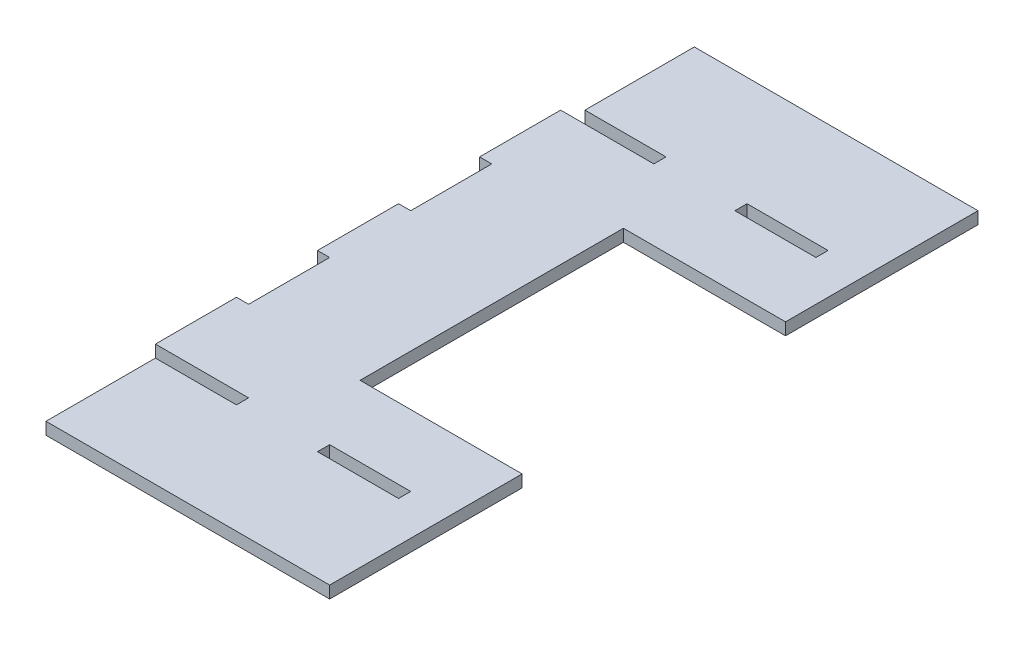
ISO-10303-21;
HEADER;
FILE_DESCRIPTION(('STEP AP214'),'2;1');
FILE_NAME('part.step','',(''),(''),'','','');
FILE_SCHEMA(('AUTOMOTIVE_DESIGN { 1 0 10303 214 1 1 1 1 }'));
ENDSEC;
DATA;
#1=APPLICATION_CONTEXT('core data for automotive mechanical design processes');
#2=APPLICATION_PROTOCOL_DEFINITION('international standard','automotive_design',2000,#1);
#3=PRODUCT_CONTEXT('',#1,'mechanical');
#4=PRODUCT('Part','Part','',(#3));
#5=PRODUCT_RELATED_PRODUCT_CATEGORY('part','',(#4));
#6=PRODUCT_DEFINITION_FORMATION('','',#4);
#7=PRODUCT_DEFINITION_CONTEXT('part definition',#1,'design');
#8=PRODUCT_DEFINITION('design','',#6,#7);
#9=PRODUCT_DEFINITION_SHAPE('','',#8);
#10=(LENGTH_UNIT() NAMED_UNIT(*) SI_UNIT(.MILLI.,.METRE.));
#11=(NAMED_UNIT(*) PLANE_ANGLE_UNIT() SI_UNIT($,.RADIAN.));
#12=(NAMED_UNIT(*) SI_UNIT($,.STERADIAN.) SOLID_ANGLE_UNIT());
#13=UNCERTAINTY_MEASURE_WITH_UNIT(LENGTH_MEASURE(1.E-05),#10,'distance_accuracy_value','');
#14=(GEOMETRIC_REPRESENTATION_CONTEXT(3) GLOBAL_UNCERTAINTY_ASSIGNED_CONTEXT((#13)) GLOBAL_UNIT_ASSIGNED_CONTEXT((#10,
#11,#12)) REPRESENTATION_CONTEXT('',''));
#15=CARTESIAN_POINT('',(0.,0.,0.));
#16=DIRECTION('',(0.,0.,1.));
#17=DIRECTION('',(1.,0.,0.));
#18=AXIS2_PLACEMENT_3D('',#15,#16,#17);
#19=CARTESIAN_POINT('',(70.,3.,0.));
#20=DIRECTION('',(-1.,0.,0.));
#21=DIRECTION('',(0.,0.,1.));
#22=AXIS2_PLACEMENT_3D('',#19,#20,#21);
#23=PLANE('',#22);
#24=DIRECTION('',(0.,1.,0.));
#25=VECTOR('',#24,1.);
#26=CARTESIAN_POINT('',(70.,-22.,-47.5));
#27=LINE('',#26,#25);
#28=CARTESIAN_POINT('',(70.,0.,-47.5));
#29=VERTEX_POINT('',#28);
#30=CARTESIAN_POINT('',(70.,3.,-47.5));
#31=VERTEX_POINT('',#30);
#32=EDGE_CURVE('E296',#29,#31,#27,.T.);
#33=ORIENTED_EDGE('',*,*,#32,.T.);
#34=DIRECTION('',(0.,0.,-1.));
#35=VECTOR('',#34,1.);
#36=CARTESIAN_POINT('',(70.,3.,0.));
#37=LINE('',#36,#35);
#38=CARTESIAN_POINT('',(70.,3.,0.));
#39=VERTEX_POINT('',#38);
#40=EDGE_CURVE('E279',#39,#31,#37,.T.);
#41=ORIENTED_EDGE('',*,*,#40,.F.);
#42=DIRECTION('',(0.,-1.,0.));
#43=VECTOR('',#42,1.);
#44=CARTESIAN_POINT('',(70.,3.,0.));
#45=LINE('',#44,#43);
#46=CARTESIAN_POINT('',(70.,0.,0.));
#47=VERTEX_POINT('',#46);
#48=EDGE_CURVE('E632',#39,#47,#45,.T.);
#49=ORIENTED_EDGE('',*,*,#48,.T.);
#50=DIRECTION('',(0.,0.,-1.));
#51=VECTOR('',#50,1.);
#52=CARTESIAN_POINT('',(70.,0.,0.));
#53=LINE('',#52,#51);
#54=EDGE_CURVE('E612',#47,#29,#53,.T.);
#55=ORIENTED_EDGE('',*,*,#54,.T.);
#56=EDGE_LOOP('',(#33,#41,#49,#55));
#57=FACE_BOUND('',#56,.T.);
#58=ADVANCED_FACE('F48',(#57),#23,.F.);
#59=CARTESIAN_POINT('',(0.,3.,0.));
#60=DIRECTION('',(0.,-1.,0.));
#61=DIRECTION('',(0.,0.,-1.));
#62=AXIS2_PLACEMENT_3D('',#59,#60,#61);
#63=PLANE('',#62);
#64=DIRECTION('',(1.,0.,0.));
#65=VECTOR('',#64,1.);
#66=CARTESIAN_POINT('',(40.,3.,-130.));
#67=LINE('',#66,#65);
#68=CARTESIAN_POINT('',(40.,3.,-130.));
#69=VERTEX_POINT('',#68);
#70=CARTESIAN_POINT('',(60.,3.,-130.));
#71=VERTEX_POINT('',#70);
#72=EDGE_CURVE('E540',#69,#71,#67,.T.);
#73=ORIENTED_EDGE('',*,*,#72,.F.);
#74=DIRECTION('',(0.,0.,1.));
#75=VECTOR('',#74,1.);
#76=CARTESIAN_POINT('',(40.,3.,-133.));
#77=LINE('',#76,#75);
#78=CARTESIAN_POINT('',(40.,3.,-133.));
#79=VERTEX_POINT('',#78);
#80=EDGE_CURVE('E535',#79,#69,#77,.T.);
#81=ORIENTED_EDGE('',*,*,#80,.F.);
#82=DIRECTION('',(-1.,0.,0.));
#83=VECTOR('',#82,1.);
#84=CARTESIAN_POINT('',(40.,3.,-133.));
#85=LINE('',#84,#83);
#86=CARTESIAN_POINT('',(60.,3.,-133.));
#87=VERTEX_POINT('',#86);
#88=EDGE_CURVE('E521',#87,#79,#85,.T.);
#89=ORIENTED_EDGE('',*,*,#88,.F.);
#90=DIRECTION('',(0.,0.,-1.));
#91=VECTOR('',#90,1.);
#92=CARTESIAN_POINT('',(60.,3.,-133.));
#93=LINE('',#92,#91);
#94=EDGE_CURVE('E551',#71,#87,#93,.T.);
#95=ORIENTED_EDGE('',*,*,#94,.F.);
#96=EDGE_LOOP('',(#73,#81,#89,#95));
#97=FACE_BOUND('',#96,.T.);
#98=DIRECTION('',(1.,0.,0.));
#99=VECTOR('',#98,1.);
#100=CARTESIAN_POINT('',(40.,3.,-27.));
#101=LINE('',#100,#99);
#102=CARTESIAN_POINT('',(40.,3.,-27.));
#103=VERTEX_POINT('',#102);
#104=CARTESIAN_POINT('',(60.,3.,-27.));
#105=VERTEX_POINT('',#104);
#106=EDGE_CURVE('E466',#103,#105,#101,.T.);
#107=ORIENTED_EDGE('',*,*,#106,.F.);
#108=DIRECTION('',(0.,0.,1.));
#109=VECTOR('',#108,1.);
#110=CARTESIAN_POINT('',(40.,3.,-30.));
#111=LINE('',#110,#109);
#112=CARTESIAN_POINT('',(40.,3.,-30.));
#113=VERTEX_POINT('',#112);
#114=EDGE_CURVE('E458',#113,#103,#111,.T.);
#115=ORIENTED_EDGE('',*,*,#114,.F.);
#116=DIRECTION('',(-1.,0.,0.));
#117=VECTOR('',#116,1.);
#118=CARTESIAN_POINT('',(40.,3.,-30.));
#119=LINE('',#118,#117);
#120=CARTESIAN_POINT('',(60.,3.,-30.));
#121=VERTEX_POINT('',#120);
#122=EDGE_CURVE('E484',#121,#113,#119,.T.);
#123=ORIENTED_EDGE('',*,*,#122,.F.);
#124=DIRECTION('',(0.,0.,-1.));
#125=VECTOR('',#124,1.);
#126=CARTESIAN_POINT('',(60.,3.,-30.));
#127=LINE('',#126,#125);
#128=EDGE_CURVE('E473',#105,#121,#127,.T.);
#129=ORIENTED_EDGE('',*,*,#128,.F.);
#130=EDGE_LOOP('',(#107,#115,#123,#129));
#131=FACE_BOUND('',#130,.T.);
#132=DIRECTION('',(-1.,0.,0.));
#133=VECTOR('',#132,1.);
#134=CARTESIAN_POINT('',(70.,3.,-47.5));
#135=LINE('',#134,#133);
#136=CARTESIAN_POINT('',(30.,3.,-47.5));
#137=VERTEX_POINT('',#136);
#138=EDGE_CURVE('E261',#31,#137,#135,.T.);
#139=ORIENTED_EDGE('',*,*,#138,.T.);
#140=DIRECTION('',(0.,0.,-1.));
#141=VECTOR('',#140,1.);
#142=CARTESIAN_POINT('',(30.,3.,-47.5));
#143=LINE('',#142,#141);
#144=CARTESIAN_POINT('',(30.,3.,-112.5));
#145=VERTEX_POINT('',#144);
#146=EDGE_CURVE('E269',#137,#145,#143,.T.);
#147=ORIENTED_EDGE('',*,*,#146,.T.);
#148=DIRECTION('',(-1.,0.,0.));
#149=VECTOR('',#148,1.);
#150=CARTESIAN_POINT('',(70.,3.,-112.5));
#151=LINE('',#150,#149);
#152=CARTESIAN_POINT('',(70.,3.,-112.5));
#153=VERTEX_POINT('',#152);
#154=EDGE_CURVE('E274',#153,#145,#151,.T.);
#155=ORIENTED_EDGE('',*,*,#154,.F.);
#156=CARTESIAN_POINT('',(70.,3.,-160.));
#157=VERTEX_POINT('',#156);
#158=EDGE_CURVE('E654',#153,#157,#37,.T.);
#159=ORIENTED_EDGE('',*,*,#158,.T.);
#160=DIRECTION('',(-1.,0.,0.));
#161=VECTOR('',#160,1.);
#162=CARTESIAN_POINT('',(0.,3.,-160.));
#163=LINE('',#162,#161);
#164=CARTESIAN_POINT('',(0.,3.,-160.));
#165=VERTEX_POINT('',#164);
#166=EDGE_CURVE('E629',#157,#165,#163,.T.);
#167=ORIENTED_EDGE('',*,*,#166,.T.);
#168=DIRECTION('',(0.,0.,1.));
#169=VECTOR('',#168,1.);
#170=CARTESIAN_POINT('',(0.,3.,0.));
#171=LINE('',#170,#169);
#172=CARTESIAN_POINT('',(0.,3.,-133.));
#173=VERTEX_POINT('',#172);
#174=EDGE_CURVE('E349',#165,#173,#171,.T.);
#175=ORIENTED_EDGE('',*,*,#174,.T.);
#176=DIRECTION('',(-1.,0.,0.));
#177=VECTOR('',#176,1.);
#178=CARTESIAN_POINT('',(0.,3.,-133.));
#179=LINE('',#178,#177);
#180=CARTESIAN_POINT('',(20.,3.,-133.));
#181=VERTEX_POINT('',#180);
#182=EDGE_CURVE('E445',#181,#173,#179,.T.);
#183=ORIENTED_EDGE('',*,*,#182,.F.);
#184=DIRECTION('',(0.,0.,-1.));
#185=VECTOR('',#184,1.);
#186=CARTESIAN_POINT('',(20.,3.,-133.));
#187=LINE('',#186,#185);
#188=CARTESIAN_POINT('',(20.,3.,-130.));
#189=VERTEX_POINT('',#188);
#190=EDGE_CURVE('E429',#189,#181,#187,.T.);
#191=ORIENTED_EDGE('',*,*,#190,.F.);
#192=DIRECTION('',(1.,0.,0.));
#193=VECTOR('',#192,1.);
#194=CARTESIAN_POINT('',(0.,3.,-130.));
#195=LINE('',#194,#193);
#196=CARTESIAN_POINT('',(-3.,3.,-130.));
#197=VERTEX_POINT('',#196);
#198=EDGE_CURVE('E423',#197,#189,#195,.T.);
#199=ORIENTED_EDGE('',*,*,#198,.F.);
#200=DIRECTION('',(0.,0.,1.));
#201=VECTOR('',#200,1.);
#202=CARTESIAN_POINT('',(-3.,3.,-130.));
#203=LINE('',#202,#201);
#204=CARTESIAN_POINT('',(-3.,3.,-110.));
#205=VERTEX_POINT('',#204);
#206=EDGE_CURVE('E390',#197,#205,#203,.T.);
#207=ORIENTED_EDGE('',*,*,#206,.T.);
#208=DIRECTION('',(1.,0.,0.));
#209=VECTOR('',#208,1.);
#210=CARTESIAN_POINT('',(0.,3.,-110.));
#211=LINE('',#210,#209);
#212=CARTESIAN_POINT('',(0.,3.,-110.));
#213=VERTEX_POINT('',#212);
#214=EDGE_CURVE('E408',#205,#213,#211,.T.);
#215=ORIENTED_EDGE('',*,*,#214,.T.);
#216=CARTESIAN_POINT('',(0.,3.,-90.));
#217=VERTEX_POINT('',#216);
#218=EDGE_CURVE('E355',#213,#217,#171,.T.);
#219=ORIENTED_EDGE('',*,*,#218,.T.);
#220=DIRECTION('',(-1.,0.,0.));
#221=VECTOR('',#220,1.);
#222=CARTESIAN_POINT('',(0.,3.,-90.));
#223=LINE('',#222,#221);
#224=CARTESIAN_POINT('',(-3.,3.,-90.));
#225=VERTEX_POINT('',#224);
#226=EDGE_CURVE('E385',#217,#225,#223,.T.);
#227=ORIENTED_EDGE('',*,*,#226,.T.);
#228=DIRECTION('',(0.,0.,1.));
#229=VECTOR('',#228,1.);
#230=CARTESIAN_POINT('',(-3.,3.,-90.));
#231=LINE('',#230,#229);
#232=CARTESIAN_POINT('',(-3.,3.,-70.));
#233=VERTEX_POINT('',#232);
#234=EDGE_CURVE('E377',#225,#233,#231,.T.);
#235=ORIENTED_EDGE('',*,*,#234,.T.);
#236=DIRECTION('',(1.,0.,0.));
#237=VECTOR('',#236,1.);
#238=CARTESIAN_POINT('',(0.,3.,-70.));
#239=LINE('',#238,#237);
#240=CARTESIAN_POINT('',(0.,3.,-70.));
#241=VERTEX_POINT('',#240);
#242=EDGE_CURVE('E372',#233,#241,#239,.T.);
#243=ORIENTED_EDGE('',*,*,#242,.T.);
#244=CARTESIAN_POINT('',(0.,3.,-50.));
#245=VERTEX_POINT('',#244);
#246=EDGE_CURVE('E356',#241,#245,#171,.T.);
#247=ORIENTED_EDGE('',*,*,#246,.T.);
#248=DIRECTION('',(-1.,0.,0.));
#249=VECTOR('',#248,1.);
#250=CARTESIAN_POINT('',(0.,3.,-50.));
#251=LINE('',#250,#249);
#252=CARTESIAN_POINT('',(-3.,3.,-50.));
#253=VERTEX_POINT('',#252);
#254=EDGE_CURVE('E318',#245,#253,#251,.T.);
#255=ORIENTED_EDGE('',*,*,#254,.T.);
#256=DIRECTION('',(0.,0.,1.));
#257=VECTOR('',#256,1.);
#258=CARTESIAN_POINT('',(-3.,3.,-50.));
#259=LINE('',#258,#257);
#260=CARTESIAN_POINT('',(-3.,3.,-30.));
#261=VERTEX_POINT('',#260);
#262=EDGE_CURVE('E313',#253,#261,#259,.T.);
#263=ORIENTED_EDGE('',*,*,#262,.T.);
#264=DIRECTION('',(-1.,0.,0.));
#265=VECTOR('',#264,1.);
#266=CARTESIAN_POINT('',(0.,3.,-30.));
#267=LINE('',#266,#265);
#268=CARTESIAN_POINT('',(20.,3.,-30.));
#269=VERTEX_POINT('',#268);
#270=EDGE_CURVE('E330',#269,#261,#267,.T.);
#271=ORIENTED_EDGE('',*,*,#270,.F.);
#272=DIRECTION('',(0.,0.,-1.));
#273=VECTOR('',#272,1.);
#274=CARTESIAN_POINT('',(20.,3.,-30.));
#275=LINE('',#274,#273);
#276=CARTESIAN_POINT('',(20.,3.,-27.));
#277=VERTEX_POINT('',#276);
#278=EDGE_CURVE('E335',#277,#269,#275,.T.);
#279=ORIENTED_EDGE('',*,*,#278,.F.);
#280=DIRECTION('',(1.,0.,0.));
#281=VECTOR('',#280,1.);
#282=CARTESIAN_POINT('',(0.,3.,-27.));
#283=LINE('',#282,#281);
#284=CARTESIAN_POINT('',(0.,3.,-27.));
#285=VERTEX_POINT('',#284);
#286=EDGE_CURVE('E454',#285,#277,#283,.T.);
#287=ORIENTED_EDGE('',*,*,#286,.F.);
#288=CARTESIAN_POINT('',(0.,3.,0.));
#289=VERTEX_POINT('',#288);
#290=EDGE_CURVE('E357',#285,#289,#171,.T.);
#291=ORIENTED_EDGE('',*,*,#290,.T.);
#292=DIRECTION('',(1.,0.,0.));
#293=VECTOR('',#292,1.);
#294=CARTESIAN_POINT('',(0.,3.,0.));
#295=LINE('',#294,#293);
#296=EDGE_CURVE('E354',#289,#39,#295,.T.);
#297=ORIENTED_EDGE('',*,*,#296,.T.);
#298=ORIENTED_EDGE('',*,*,#40,.T.);
#299=EDGE_LOOP('',(#139,#147,#155,#159,#167,#175,#183,#191,#199,#207,#215,#219,#227,#235,#243,
#247,#255,#263,#271,#279,#287,#291,#297,#298));
#300=FACE_BOUND('',#299,.T.);
#301=ADVANCED_FACE('F277',(#97,#131,#300),#63,.F.);
#302=CARTESIAN_POINT('',(0.,0.,0.));
#303=DIRECTION('',(0.,-1.,0.));
#304=DIRECTION('',(0.,0.,-1.));
#305=AXIS2_PLACEMENT_3D('',#302,#303,#304);
#306=PLANE('',#305);
#307=DIRECTION('',(0.,0.,1.));
#308=VECTOR('',#307,1.);
#309=CARTESIAN_POINT('',(40.,0.,-30.));
#310=LINE('',#309,#308);
#311=CARTESIAN_POINT('',(40.,0.,-30.));
#312=VERTEX_POINT('',#311);
#313=CARTESIAN_POINT('',(40.,0.,-27.));
#314=VERTEX_POINT('',#313);
#315=EDGE_CURVE('E489',#312,#314,#310,.T.);
#316=ORIENTED_EDGE('',*,*,#315,.T.);
#317=DIRECTION('',(1.,0.,0.));
#318=VECTOR('',#317,1.);
#319=CARTESIAN_POINT('',(40.,0.,-27.));
#320=LINE('',#319,#318);
#321=CARTESIAN_POINT('',(60.,0.,-27.));
#322=VERTEX_POINT('',#321);
#323=EDGE_CURVE('E1062',#314,#322,#320,.T.);
#324=ORIENTED_EDGE('',*,*,#323,.T.);
#325=DIRECTION('',(0.,0.,-1.));
#326=VECTOR('',#325,1.);
#327=CARTESIAN_POINT('',(60.,0.,-30.));
#328=LINE('',#327,#326);
#329=CARTESIAN_POINT('',(60.,0.,-30.));
#330=VERTEX_POINT('',#329);
#331=EDGE_CURVE('E1065',#322,#330,#328,.T.);
#332=ORIENTED_EDGE('',*,*,#331,.T.);
#333=DIRECTION('',(-1.,0.,0.));
#334=VECTOR('',#333,1.);
#335=CARTESIAN_POINT('',(40.,0.,-30.));
#336=LINE('',#335,#334);
#337=EDGE_CURVE('E478',#330,#312,#336,.T.);
#338=ORIENTED_EDGE('',*,*,#337,.T.);
#339=EDGE_LOOP('',(#316,#324,#332,#338));
#340=FACE_BOUND('',#339,.T.);
#341=DIRECTION('',(0.,0.,1.));
#342=VECTOR('',#341,1.);
#343=CARTESIAN_POINT('',(40.,0.,-133.));
#344=LINE('',#343,#342);
#345=CARTESIAN_POINT('',(40.,0.,-133.));
#346=VERTEX_POINT('',#345);
#347=CARTESIAN_POINT('',(40.,0.,-130.));
#348=VERTEX_POINT('',#347);
#349=EDGE_CURVE('E517',#346,#348,#344,.T.);
#350=ORIENTED_EDGE('',*,*,#349,.T.);
#351=DIRECTION('',(1.,0.,0.));
#352=VECTOR('',#351,1.);
#353=CARTESIAN_POINT('',(40.,0.,-130.));
#354=LINE('',#353,#352);
#355=CARTESIAN_POINT('',(60.,0.,-130.));
#356=VERTEX_POINT('',#355);
#357=EDGE_CURVE('E522',#348,#356,#354,.T.);
#358=ORIENTED_EDGE('',*,*,#357,.T.);
#359=DIRECTION('',(0.,0.,-1.));
#360=VECTOR('',#359,1.);
#361=CARTESIAN_POINT('',(60.,0.,-133.));
#362=LINE('',#361,#360);
#363=CARTESIAN_POINT('',(60.,0.,-133.));
#364=VERTEX_POINT('',#363);
#365=EDGE_CURVE('E526',#356,#364,#362,.T.);
#366=ORIENTED_EDGE('',*,*,#365,.T.);
#367=DIRECTION('',(-1.,0.,0.));
#368=VECTOR('',#367,1.);
#369=CARTESIAN_POINT('',(40.,0.,-133.));
#370=LINE('',#369,#368);
#371=EDGE_CURVE('E530',#364,#346,#370,.T.);
#372=ORIENTED_EDGE('',*,*,#371,.T.);
#373=EDGE_LOOP('',(#350,#358,#366,#372));
#374=FACE_BOUND('',#373,.T.);
#375=DIRECTION('',(0.,0.,1.));
#376=VECTOR('',#375,1.);
#377=CARTESIAN_POINT('',(30.,0.,0.));
#378=LINE('',#377,#376);
#379=CARTESIAN_POINT('',(30.,0.,-112.5));
#380=VERTEX_POINT('',#379);
#381=CARTESIAN_POINT('',(30.,0.,-47.5));
#382=VERTEX_POINT('',#381);
#383=EDGE_CURVE('E57',#380,#382,#378,.T.);
#384=ORIENTED_EDGE('',*,*,#383,.T.);
#385=DIRECTION('',(1.,0.,0.));
#386=VECTOR('',#385,1.);
#387=CARTESIAN_POINT('',(0.,0.,-47.5));
#388=LINE('',#387,#386);
#389=EDGE_CURVE('E12',#382,#29,#388,.T.);
#390=ORIENTED_EDGE('',*,*,#389,.T.);
#391=ORIENTED_EDGE('',*,*,#54,.F.);
#392=DIRECTION('',(1.,0.,0.));
#393=VECTOR('',#392,1.);
#394=CARTESIAN_POINT('',(0.,0.,0.));
#395=LINE('',#394,#393);
#396=CARTESIAN_POINT('',(0.,0.,0.));
#397=VERTEX_POINT('',#396);
#398=EDGE_CURVE('E668',#397,#47,#395,.T.);
#399=ORIENTED_EDGE('',*,*,#398,.F.);
#400=DIRECTION('',(0.,0.,1.));
#401=VECTOR('',#400,1.);
#402=CARTESIAN_POINT('',(0.,0.,0.));
#403=LINE('',#402,#401);
#404=CARTESIAN_POINT('',(0.,0.,-27.));
#405=VERTEX_POINT('',#404);
#406=EDGE_CURVE('E341',#405,#397,#403,.T.);
#407=ORIENTED_EDGE('',*,*,#406,.F.);
#408=DIRECTION('',(1.,0.,0.));
#409=VECTOR('',#408,1.);
#410=CARTESIAN_POINT('',(0.,0.,-27.));
#411=LINE('',#410,#409);
#412=CARTESIAN_POINT('',(20.,0.,-27.));
#413=VERTEX_POINT('',#412);
#414=EDGE_CURVE('E334',#405,#413,#411,.T.);
#415=ORIENTED_EDGE('',*,*,#414,.T.);
#416=DIRECTION('',(0.,0.,-1.));
#417=VECTOR('',#416,1.);
#418=CARTESIAN_POINT('',(20.,0.,-30.));
#419=LINE('',#418,#417);
#420=CARTESIAN_POINT('',(20.,0.,-30.));
#421=VERTEX_POINT('',#420);
#422=EDGE_CURVE('E449',#413,#421,#419,.T.);
#423=ORIENTED_EDGE('',*,*,#422,.T.);
#424=DIRECTION('',(-1.,0.,0.));
#425=VECTOR('',#424,1.);
#426=CARTESIAN_POINT('',(0.,0.,-30.));
#427=LINE('',#426,#425);
#428=CARTESIAN_POINT('',(-3.,0.,-30.));
#429=VERTEX_POINT('',#428);
#430=EDGE_CURVE('E348',#421,#429,#427,.T.);
#431=ORIENTED_EDGE('',*,*,#430,.T.);
#432=DIRECTION('',(0.,0.,1.));
#433=VECTOR('',#432,1.);
#434=CARTESIAN_POINT('',(-3.,0.,-50.));
#435=LINE('',#434,#433);
#436=CARTESIAN_POINT('',(-3.,0.,-50.));
#437=VERTEX_POINT('',#436);
#438=EDGE_CURVE('E306',#437,#429,#435,.T.);
#439=ORIENTED_EDGE('',*,*,#438,.F.);
#440=DIRECTION('',(-1.,0.,0.));
#441=VECTOR('',#440,1.);
#442=CARTESIAN_POINT('',(0.,0.,-50.));
#443=LINE('',#442,#441);
#444=CARTESIAN_POINT('',(0.,0.,-50.));
#445=VERTEX_POINT('',#444);
#446=EDGE_CURVE('E319',#445,#437,#443,.T.);
#447=ORIENTED_EDGE('',*,*,#446,.F.);
#448=CARTESIAN_POINT('',(0.,0.,-70.));
#449=VERTEX_POINT('',#448);
#450=EDGE_CURVE('E670',#449,#445,#403,.T.);
#451=ORIENTED_EDGE('',*,*,#450,.F.);
#452=DIRECTION('',(1.,0.,0.));
#453=VECTOR('',#452,1.);
#454=CARTESIAN_POINT('',(0.,0.,-70.));
#455=LINE('',#454,#453);
#456=CARTESIAN_POINT('',(-3.,0.,-70.));
#457=VERTEX_POINT('',#456);
#458=EDGE_CURVE('E391',#457,#449,#455,.T.);
#459=ORIENTED_EDGE('',*,*,#458,.F.);
#460=DIRECTION('',(0.,0.,1.));
#461=VECTOR('',#460,1.);
#462=CARTESIAN_POINT('',(-3.,0.,-90.));
#463=LINE('',#462,#461);
#464=CARTESIAN_POINT('',(-3.,0.,-90.));
#465=VERTEX_POINT('',#464);
#466=EDGE_CURVE('E395',#465,#457,#463,.T.);
#467=ORIENTED_EDGE('',*,*,#466,.F.);
#468=DIRECTION('',(-1.,0.,0.));
#469=VECTOR('',#468,1.);
#470=CARTESIAN_POINT('',(0.,0.,-90.));
#471=LINE('',#470,#469);
#472=CARTESIAN_POINT('',(0.,0.,-90.));
#473=VERTEX_POINT('',#472);
#474=EDGE_CURVE('E378',#473,#465,#471,.T.);
#475=ORIENTED_EDGE('',*,*,#474,.F.);
#476=CARTESIAN_POINT('',(0.,0.,-110.));
#477=VERTEX_POINT('',#476);
#478=EDGE_CURVE('E669',#477,#473,#403,.T.);
#479=ORIENTED_EDGE('',*,*,#478,.F.);
#480=DIRECTION('',(1.,0.,0.));
#481=VECTOR('',#480,1.);
#482=CARTESIAN_POINT('',(0.,0.,-110.));
#483=LINE('',#482,#481);
#484=CARTESIAN_POINT('',(-3.,0.,-110.));
#485=VERTEX_POINT('',#484);
#486=EDGE_CURVE('E407',#485,#477,#483,.T.);
#487=ORIENTED_EDGE('',*,*,#486,.F.);
#488=DIRECTION('',(0.,0.,1.));
#489=VECTOR('',#488,1.);
#490=CARTESIAN_POINT('',(-3.,0.,-130.));
#491=LINE('',#490,#489);
#492=CARTESIAN_POINT('',(-3.,0.,-130.));
#493=VERTEX_POINT('',#492);
#494=EDGE_CURVE('E403',#493,#485,#491,.T.);
#495=ORIENTED_EDGE('',*,*,#494,.F.);
#496=DIRECTION('',(1.,0.,0.));
#497=VECTOR('',#496,1.);
#498=CARTESIAN_POINT('',(0.,0.,-130.));
#499=LINE('',#498,#497);
#500=CARTESIAN_POINT('',(20.,0.,-130.));
#501=VERTEX_POINT('',#500);
#502=EDGE_CURVE('E441',#493,#501,#499,.T.);
#503=ORIENTED_EDGE('',*,*,#502,.T.);
#504=DIRECTION('',(0.,0.,-1.));
#505=VECTOR('',#504,1.);
#506=CARTESIAN_POINT('',(20.,0.,-133.));
#507=LINE('',#506,#505);
#508=CARTESIAN_POINT('',(20.,0.,-133.));
#509=VERTEX_POINT('',#508);
#510=EDGE_CURVE('E436',#501,#509,#507,.T.);
#511=ORIENTED_EDGE('',*,*,#510,.T.);
#512=DIRECTION('',(-1.,0.,0.));
#513=VECTOR('',#512,1.);
#514=CARTESIAN_POINT('',(0.,0.,-133.));
#515=LINE('',#514,#513);
#516=CARTESIAN_POINT('',(0.,0.,-133.));
#517=VERTEX_POINT('',#516);
#518=EDGE_CURVE('E432',#509,#517,#515,.T.);
#519=ORIENTED_EDGE('',*,*,#518,.T.);
#520=CARTESIAN_POINT('',(0.,0.,-160.));
#521=VERTEX_POINT('',#520);
#522=EDGE_CURVE('E665',#521,#517,#403,.T.);
#523=ORIENTED_EDGE('',*,*,#522,.F.);
#524=DIRECTION('',(-1.,0.,0.));
#525=VECTOR('',#524,1.);
#526=CARTESIAN_POINT('',(0.,0.,-160.));
#527=LINE('',#526,#525);
#528=CARTESIAN_POINT('',(70.,0.,-160.));
#529=VERTEX_POINT('',#528);
#530=EDGE_CURVE('E608',#529,#521,#527,.T.);
#531=ORIENTED_EDGE('',*,*,#530,.F.);
#532=CARTESIAN_POINT('',(70.,0.,-112.5));
#533=VERTEX_POINT('',#532);
#534=EDGE_CURVE('E621',#533,#529,#53,.T.);
#535=ORIENTED_EDGE('',*,*,#534,.F.);
#536=DIRECTION('',(1.,0.,0.));
#537=VECTOR('',#536,1.);
#538=CARTESIAN_POINT('',(0.,0.,-112.5));
#539=LINE('',#538,#537);
#540=EDGE_CURVE('E640',#380,#533,#539,.T.);
#541=ORIENTED_EDGE('',*,*,#540,.F.);
#542=EDGE_LOOP('',(#384,#390,#391,#399,#407,#415,#423,#431,#439,#447,#451,#459,#467,#475,#479,
#487,#495,#503,#511,#519,#523,#531,#535,#541));
#543=FACE_BOUND('',#542,.T.);
#544=ADVANCED_FACE('F645',(#340,#374,#543),#306,.T.);
#545=CARTESIAN_POINT('',(0.,3.,0.));
#546=DIRECTION('',(1.,0.,0.));
#547=DIRECTION('',(0.,0.,-1.));
#548=AXIS2_PLACEMENT_3D('',#545,#546,#547);
#549=PLANE('',#548);
#550=ORIENTED_EDGE('',*,*,#450,.T.);
#551=DIRECTION('',(0.,1.,0.));
#552=VECTOR('',#551,1.);
#553=CARTESIAN_POINT('',(0.,0.,-50.));
#554=LINE('',#553,#552);
#555=EDGE_CURVE('E72',#445,#245,#554,.T.);
#556=ORIENTED_EDGE('',*,*,#555,.T.);
#557=ORIENTED_EDGE('',*,*,#246,.F.);
#558=DIRECTION('',(0.,1.,0.));
#559=VECTOR('',#558,1.);
#560=CARTESIAN_POINT('',(0.,0.,-70.));
#561=LINE('',#560,#559);
#562=EDGE_CURVE('E379',#449,#241,#561,.T.);
#563=ORIENTED_EDGE('',*,*,#562,.F.);
#564=EDGE_LOOP('',(#550,#556,#557,#563));
#565=FACE_BOUND('',#564,.T.);
#566=ADVANCED_FACE('F701',(#565),#549,.F.);
#567=ORIENTED_EDGE('',*,*,#522,.T.);
#568=DIRECTION('',(0.,1.,0.));
#569=VECTOR('',#568,1.);
#570=CARTESIAN_POINT('',(0.,0.,-133.));
#571=LINE('',#570,#569);
#572=EDGE_CURVE('E539',#517,#173,#571,.T.);
#573=ORIENTED_EDGE('',*,*,#572,.T.);
#574=ORIENTED_EDGE('',*,*,#174,.F.);
#575=DIRECTION('',(0.,-1.,0.));
#576=VECTOR('',#575,1.);
#577=CARTESIAN_POINT('',(0.,3.,-160.));
#578=LINE('',#577,#576);
#579=EDGE_CURVE('E625',#165,#521,#578,.T.);
#580=ORIENTED_EDGE('',*,*,#579,.T.);
#581=EDGE_LOOP('',(#567,#573,#574,#580));
#582=FACE_BOUND('',#581,.T.);
#583=ADVANCED_FACE('F707',(#582),#549,.F.);
#584=ORIENTED_EDGE('',*,*,#478,.T.);
#585=DIRECTION('',(0.,1.,0.));
#586=VECTOR('',#585,1.);
#587=CARTESIAN_POINT('',(0.,0.,-90.));
#588=LINE('',#587,#586);
#589=EDGE_CURVE('E396',#473,#217,#588,.T.);
#590=ORIENTED_EDGE('',*,*,#589,.T.);
#591=ORIENTED_EDGE('',*,*,#218,.F.);
#592=DIRECTION('',(0.,1.,0.));
#593=VECTOR('',#592,1.);
#594=CARTESIAN_POINT('',(0.,0.,-110.));
#595=LINE('',#594,#593);
#596=EDGE_CURVE('E580',#477,#213,#595,.T.);
#597=ORIENTED_EDGE('',*,*,#596,.F.);
#598=EDGE_LOOP('',(#584,#590,#591,#597));
#599=FACE_BOUND('',#598,.T.);
#600=ADVANCED_FACE('F603',(#599),#549,.F.);
#601=ORIENTED_EDGE('',*,*,#290,.F.);
#602=DIRECTION('',(0.,1.,0.));
#603=VECTOR('',#602,1.);
#604=CARTESIAN_POINT('',(0.,0.,-27.));
#605=LINE('',#604,#603);
#606=EDGE_CURVE('E345',#405,#285,#605,.T.);
#607=ORIENTED_EDGE('',*,*,#606,.F.);
#608=ORIENTED_EDGE('',*,*,#406,.T.);
#609=DIRECTION('',(0.,-1.,0.));
#610=VECTOR('',#609,1.);
#611=CARTESIAN_POINT('',(0.,3.,0.));
#612=LINE('',#611,#610);
#613=EDGE_CURVE('E636',#289,#397,#612,.T.);
#614=ORIENTED_EDGE('',*,*,#613,.F.);
#615=EDGE_LOOP('',(#601,#607,#608,#614));
#616=FACE_BOUND('',#615,.T.);
#617=ADVANCED_FACE('F50',(#616),#549,.F.);
#618=CARTESIAN_POINT('',(0.,3.,0.));
#619=DIRECTION('',(0.,0.,-1.));
#620=DIRECTION('',(-1.,0.,0.));
#621=AXIS2_PLACEMENT_3D('',#618,#619,#620);
#622=PLANE('',#621);
#623=ORIENTED_EDGE('',*,*,#398,.T.);
#624=ORIENTED_EDGE('',*,*,#48,.F.);
#625=ORIENTED_EDGE('',*,*,#296,.F.);
#626=ORIENTED_EDGE('',*,*,#613,.T.);
#627=EDGE_LOOP('',(#623,#624,#625,#626));
#628=FACE_BOUND('',#627,.T.);
#629=ADVANCED_FACE('F676',(#628),#622,.F.);
#630=ORIENTED_EDGE('',*,*,#158,.F.);
#631=DIRECTION('',(0.,1.,0.));
#632=VECTOR('',#631,1.);
#633=CARTESIAN_POINT('',(70.,-22.,-112.5));
#634=LINE('',#633,#632);
#635=EDGE_CURVE('E299',#533,#153,#634,.T.);
#636=ORIENTED_EDGE('',*,*,#635,.F.);
#637=ORIENTED_EDGE('',*,*,#534,.T.);
#638=DIRECTION('',(0.,-1.,0.));
#639=VECTOR('',#638,1.);
#640=CARTESIAN_POINT('',(70.,3.,-160.));
#641=LINE('',#640,#639);
#642=EDGE_CURVE('E628',#157,#529,#641,.T.);
#643=ORIENTED_EDGE('',*,*,#642,.F.);
#644=EDGE_LOOP('',(#630,#636,#637,#643));
#645=FACE_BOUND('',#644,.T.);
#646=ADVANCED_FACE('F652',(#645),#23,.F.);
#647=CARTESIAN_POINT('',(0.,3.,-160.));
#648=DIRECTION('',(0.,0.,1.));
#649=DIRECTION('',(1.,0.,0.));
#650=AXIS2_PLACEMENT_3D('',#647,#648,#649);
#651=PLANE('',#650);
#652=ORIENTED_EDGE('',*,*,#530,.T.);
#653=ORIENTED_EDGE('',*,*,#579,.F.);
#654=ORIENTED_EDGE('',*,*,#166,.F.);
#655=ORIENTED_EDGE('',*,*,#642,.T.);
#656=EDGE_LOOP('',(#652,#653,#654,#655));
#657=FACE_BOUND('',#656,.T.);
#658=ADVANCED_FACE('F689',(#657),#651,.F.);
#659=CARTESIAN_POINT('',(0.,0.,-30.));
#660=DIRECTION('',(0.,0.,-1.));
#661=DIRECTION('',(-1.,0.,0.));
#662=AXIS2_PLACEMENT_3D('',#659,#660,#661);
#663=PLANE('',#662);
#664=ORIENTED_EDGE('',*,*,#270,.T.);
#665=DIRECTION('',(0.,1.,0.));
#666=VECTOR('',#665,1.);
#667=CARTESIAN_POINT('',(-3.,0.,-30.));
#668=LINE('',#667,#666);
#669=EDGE_CURVE('E266',#429,#261,#668,.T.);
#670=ORIENTED_EDGE('',*,*,#669,.F.);
#671=ORIENTED_EDGE('',*,*,#430,.F.);
#672=DIRECTION('',(0.,1.,0.));
#673=VECTOR('',#672,1.);
#674=CARTESIAN_POINT('',(20.,0.,-30.));
#675=LINE('',#674,#673);
#676=EDGE_CURVE('E338',#421,#269,#675,.T.);
#677=ORIENTED_EDGE('',*,*,#676,.T.);
#678=EDGE_LOOP('',(#664,#670,#671,#677));
#679=FACE_BOUND('',#678,.T.);
#680=ADVANCED_FACE('F695',(#679),#663,.F.);
#681=CARTESIAN_POINT('',(20.,0.,-30.));
#682=DIRECTION('',(1.,0.,0.));
#683=DIRECTION('',(0.,0.,-1.));
#684=AXIS2_PLACEMENT_3D('',#681,#682,#683);
#685=PLANE('',#684);
#686=ORIENTED_EDGE('',*,*,#278,.T.);
#687=ORIENTED_EDGE('',*,*,#676,.F.);
#688=ORIENTED_EDGE('',*,*,#422,.F.);
#689=DIRECTION('',(0.,1.,0.));
#690=VECTOR('',#689,1.);
#691=CARTESIAN_POINT('',(20.,0.,-27.));
#692=LINE('',#691,#690);
#693=EDGE_CURVE('E342',#413,#277,#692,.T.);
#694=ORIENTED_EDGE('',*,*,#693,.T.);
#695=EDGE_LOOP('',(#686,#687,#688,#694));
#696=FACE_BOUND('',#695,.T.);
#697=ADVANCED_FACE('F807',(#696),#685,.F.);
#698=CARTESIAN_POINT('',(0.,0.,-27.));
#699=DIRECTION('',(0.,0.,1.));
#700=DIRECTION('',(1.,0.,0.));
#701=AXIS2_PLACEMENT_3D('',#698,#699,#700);
#702=PLANE('',#701);
#703=ORIENTED_EDGE('',*,*,#286,.T.);
#704=ORIENTED_EDGE('',*,*,#693,.F.);
#705=ORIENTED_EDGE('',*,*,#414,.F.);
#706=ORIENTED_EDGE('',*,*,#606,.T.);
#707=EDGE_LOOP('',(#703,#704,#705,#706));
#708=FACE_BOUND('',#707,.T.);
#709=ADVANCED_FACE('F775',(#708),#702,.F.);
#710=CARTESIAN_POINT('',(40.,0.,-133.));
#711=DIRECTION('',(-1.,0.,0.));
#712=DIRECTION('',(0.,0.,1.));
#713=AXIS2_PLACEMENT_3D('',#710,#711,#712);
#714=PLANE('',#713);
#715=ORIENTED_EDGE('',*,*,#80,.T.);
#716=DIRECTION('',(0.,1.,0.));
#717=VECTOR('',#716,1.);
#718=CARTESIAN_POINT('',(40.,0.,-130.));
#719=LINE('',#718,#717);
#720=EDGE_CURVE('E534',#348,#69,#719,.T.);
#721=ORIENTED_EDGE('',*,*,#720,.F.);
#722=ORIENTED_EDGE('',*,*,#349,.F.);
#723=DIRECTION('',(0.,1.,0.));
#724=VECTOR('',#723,1.);
#725=CARTESIAN_POINT('',(40.,0.,-133.));
#726=LINE('',#725,#724);
#727=EDGE_CURVE('E552',#346,#79,#726,.T.);
#728=ORIENTED_EDGE('',*,*,#727,.T.);
#729=EDGE_LOOP('',(#715,#721,#722,#728));
#730=FACE_BOUND('',#729,.T.);
#731=ADVANCED_FACE('F772',(#730),#714,.F.);
#732=CARTESIAN_POINT('',(40.,0.,-133.));
#733=DIRECTION('',(0.,0.,-1.));
#734=DIRECTION('',(-1.,0.,0.));
#735=AXIS2_PLACEMENT_3D('',#732,#733,#734);
#736=PLANE('',#735);
#737=ORIENTED_EDGE('',*,*,#88,.T.);
#738=ORIENTED_EDGE('',*,*,#727,.F.);
#739=ORIENTED_EDGE('',*,*,#371,.F.);
#740=DIRECTION('',(0.,1.,0.));
#741=VECTOR('',#740,1.);
#742=CARTESIAN_POINT('',(60.,0.,-133.));
#743=LINE('',#742,#741);
#744=EDGE_CURVE('E575',#364,#87,#743,.T.);
#745=ORIENTED_EDGE('',*,*,#744,.T.);
#746=EDGE_LOOP('',(#737,#738,#739,#745));
#747=FACE_BOUND('',#746,.T.);
#748=ADVANCED_FACE('F572',(#747),#736,.F.);
#749=CARTESIAN_POINT('',(60.,0.,-133.));
#750=DIRECTION('',(1.,0.,0.));
#751=DIRECTION('',(0.,0.,-1.));
#752=AXIS2_PLACEMENT_3D('',#749,#750,#751);
#753=PLANE('',#752);
#754=ORIENTED_EDGE('',*,*,#94,.T.);
#755=ORIENTED_EDGE('',*,*,#744,.F.);
#756=ORIENTED_EDGE('',*,*,#365,.F.);
#757=DIRECTION('',(0.,1.,0.));
#758=VECTOR('',#757,1.);
#759=CARTESIAN_POINT('',(60.,0.,-130.));
#760=LINE('',#759,#758);
#761=EDGE_CURVE('E568',#356,#71,#760,.T.);
#762=ORIENTED_EDGE('',*,*,#761,.T.);
#763=EDGE_LOOP('',(#754,#755,#756,#762));
#764=FACE_BOUND('',#763,.T.);
#765=ADVANCED_FACE('F780',(#764),#753,.F.);
#766=CARTESIAN_POINT('',(40.,0.,-130.));
#767=DIRECTION('',(0.,0.,1.));
#768=DIRECTION('',(1.,0.,0.));
#769=AXIS2_PLACEMENT_3D('',#766,#767,#768);
#770=PLANE('',#769);
#771=ORIENTED_EDGE('',*,*,#72,.T.);
#772=ORIENTED_EDGE('',*,*,#761,.F.);
#773=ORIENTED_EDGE('',*,*,#357,.F.);
#774=ORIENTED_EDGE('',*,*,#720,.T.);
#775=EDGE_LOOP('',(#771,#772,#773,#774));
#776=FACE_BOUND('',#775,.T.);
#777=ADVANCED_FACE('F566',(#776),#770,.F.);
#778=CARTESIAN_POINT('',(0.,0.,-133.));
#779=DIRECTION('',(0.,0.,-1.));
#780=DIRECTION('',(-1.,0.,0.));
#781=AXIS2_PLACEMENT_3D('',#778,#779,#780);
#782=PLANE('',#781);
#783=ORIENTED_EDGE('',*,*,#182,.T.);
#784=ORIENTED_EDGE('',*,*,#572,.F.);
#785=ORIENTED_EDGE('',*,*,#518,.F.);
#786=DIRECTION('',(0.,1.,0.));
#787=VECTOR('',#786,1.);
#788=CARTESIAN_POINT('',(20.,0.,-133.));
#789=LINE('',#788,#787);
#790=EDGE_CURVE('E1044',#509,#181,#789,.T.);
#791=ORIENTED_EDGE('',*,*,#790,.T.);
#792=EDGE_LOOP('',(#783,#784,#785,#791));
#793=FACE_BOUND('',#792,.T.);
#794=ADVANCED_FACE('F779',(#793),#782,.F.);
#795=CARTESIAN_POINT('',(20.,0.,-133.));
#796=DIRECTION('',(1.,0.,0.));
#797=DIRECTION('',(0.,0.,-1.));
#798=AXIS2_PLACEMENT_3D('',#795,#796,#797);
#799=PLANE('',#798);
#800=ORIENTED_EDGE('',*,*,#190,.T.);
#801=ORIENTED_EDGE('',*,*,#790,.F.);
#802=ORIENTED_EDGE('',*,*,#510,.F.);
#803=DIRECTION('',(0.,1.,0.));
#804=VECTOR('',#803,1.);
#805=CARTESIAN_POINT('',(20.,0.,-130.));
#806=LINE('',#805,#804);
#807=EDGE_CURVE('E437',#501,#189,#806,.T.);
#808=ORIENTED_EDGE('',*,*,#807,.T.);
#809=EDGE_LOOP('',(#800,#801,#802,#808));
#810=FACE_BOUND('',#809,.T.);
#811=ADVANCED_FACE('F797',(#810),#799,.F.);
#812=CARTESIAN_POINT('',(0.,0.,-130.));
#813=DIRECTION('',(0.,0.,1.));
#814=DIRECTION('',(1.,0.,0.));
#815=AXIS2_PLACEMENT_3D('',#812,#813,#814);
#816=PLANE('',#815);
#817=ORIENTED_EDGE('',*,*,#198,.T.);
#818=ORIENTED_EDGE('',*,*,#807,.F.);
#819=ORIENTED_EDGE('',*,*,#502,.F.);
#820=DIRECTION('',(0.,1.,0.));
#821=VECTOR('',#820,1.);
#822=CARTESIAN_POINT('',(-3.,0.,-130.));
#823=LINE('',#822,#821);
#824=EDGE_CURVE('E411',#493,#197,#823,.T.);
#825=ORIENTED_EDGE('',*,*,#824,.T.);
#826=EDGE_LOOP('',(#817,#818,#819,#825));
#827=FACE_BOUND('',#826,.T.);
#828=ADVANCED_FACE('F788',(#827),#816,.F.);
#829=CARTESIAN_POINT('',(40.,0.,-30.));
#830=DIRECTION('',(-1.,0.,0.));
#831=DIRECTION('',(0.,0.,1.));
#832=AXIS2_PLACEMENT_3D('',#829,#830,#831);
#833=PLANE('',#832);
#834=ORIENTED_EDGE('',*,*,#114,.T.);
#835=DIRECTION('',(0.,1.,0.));
#836=VECTOR('',#835,1.);
#837=CARTESIAN_POINT('',(40.,0.,-27.));
#838=LINE('',#837,#836);
#839=EDGE_CURVE('E512',#314,#103,#838,.T.);
#840=ORIENTED_EDGE('',*,*,#839,.F.);
#841=ORIENTED_EDGE('',*,*,#315,.F.);
#842=DIRECTION('',(0.,1.,0.));
#843=VECTOR('',#842,1.);
#844=CARTESIAN_POINT('',(40.,0.,-30.));
#845=LINE('',#844,#843);
#846=EDGE_CURVE('E428',#312,#113,#845,.T.);
#847=ORIENTED_EDGE('',*,*,#846,.T.);
#848=EDGE_LOOP('',(#834,#840,#841,#847));
#849=FACE_BOUND('',#848,.T.);
#850=ADVANCED_FACE('F785',(#849),#833,.F.);
#851=CARTESIAN_POINT('',(40.,0.,-30.));
#852=DIRECTION('',(0.,0.,-1.));
#853=DIRECTION('',(-1.,0.,0.));
#854=AXIS2_PLACEMENT_3D('',#851,#852,#853);
#855=PLANE('',#854);
#856=ORIENTED_EDGE('',*,*,#122,.T.);
#857=ORIENTED_EDGE('',*,*,#846,.F.);
#858=ORIENTED_EDGE('',*,*,#337,.F.);
#859=DIRECTION('',(0.,1.,0.));
#860=VECTOR('',#859,1.);
#861=CARTESIAN_POINT('',(60.,0.,-30.));
#862=LINE('',#861,#860);
#863=EDGE_CURVE('E498',#330,#121,#862,.T.);
#864=ORIENTED_EDGE('',*,*,#863,.T.);
#865=EDGE_LOOP('',(#856,#857,#858,#864));
#866=FACE_BOUND('',#865,.T.);
#867=ADVANCED_FACE('F505',(#866),#855,.F.);
#868=CARTESIAN_POINT('',(60.,0.,-30.));
#869=DIRECTION('',(1.,0.,0.));
#870=DIRECTION('',(0.,0.,-1.));
#871=AXIS2_PLACEMENT_3D('',#868,#869,#870);
#872=PLANE('',#871);
#873=ORIENTED_EDGE('',*,*,#128,.T.);
#874=ORIENTED_EDGE('',*,*,#863,.F.);
#875=ORIENTED_EDGE('',*,*,#331,.F.);
#876=DIRECTION('',(0.,1.,0.));
#877=VECTOR('',#876,1.);
#878=CARTESIAN_POINT('',(60.,0.,-27.));
#879=LINE('',#878,#877);
#880=EDGE_CURVE('E501',#322,#105,#879,.T.);
#881=ORIENTED_EDGE('',*,*,#880,.T.);
#882=EDGE_LOOP('',(#873,#874,#875,#881));
#883=FACE_BOUND('',#882,.T.);
#884=ADVANCED_FACE('F497',(#883),#872,.F.);
#885=CARTESIAN_POINT('',(40.,0.,-27.));
#886=DIRECTION('',(0.,0.,1.));
#887=DIRECTION('',(1.,0.,0.));
#888=AXIS2_PLACEMENT_3D('',#885,#886,#887);
#889=PLANE('',#888);
#890=ORIENTED_EDGE('',*,*,#106,.T.);
#891=ORIENTED_EDGE('',*,*,#880,.F.);
#892=ORIENTED_EDGE('',*,*,#323,.F.);
#893=ORIENTED_EDGE('',*,*,#839,.T.);
#894=EDGE_LOOP('',(#890,#891,#892,#893));
#895=FACE_BOUND('',#894,.T.);
#896=ADVANCED_FACE('F768',(#895),#889,.F.);
#897=CARTESIAN_POINT('',(0.,0.,-110.));
#898=DIRECTION('',(0.,0.,1.));
#899=DIRECTION('',(1.,0.,0.));
#900=AXIS2_PLACEMENT_3D('',#897,#898,#899);
#901=PLANE('',#900);
#902=ORIENTED_EDGE('',*,*,#214,.F.);
#903=DIRECTION('',(0.,1.,0.));
#904=VECTOR('',#903,1.);
#905=CARTESIAN_POINT('',(-3.,0.,-110.));
#906=LINE('',#905,#904);
#907=EDGE_CURVE('E587',#485,#205,#906,.T.);
#908=ORIENTED_EDGE('',*,*,#907,.F.);
#909=ORIENTED_EDGE('',*,*,#486,.T.);
#910=ORIENTED_EDGE('',*,*,#596,.T.);
#911=EDGE_LOOP('',(#902,#908,#909,#910));
#912=FACE_BOUND('',#911,.T.);
#913=ADVANCED_FACE('F594',(#912),#901,.T.);
#914=CARTESIAN_POINT('',(-3.,0.,-130.));
#915=DIRECTION('',(-1.,0.,0.));
#916=DIRECTION('',(0.,0.,1.));
#917=AXIS2_PLACEMENT_3D('',#914,#915,#916);
#918=PLANE('',#917);
#919=ORIENTED_EDGE('',*,*,#206,.F.);
#920=ORIENTED_EDGE('',*,*,#824,.F.);
#921=ORIENTED_EDGE('',*,*,#494,.T.);
#922=ORIENTED_EDGE('',*,*,#907,.T.);
#923=EDGE_LOOP('',(#919,#920,#921,#922));
#924=FACE_BOUND('',#923,.T.);
#925=ADVANCED_FACE('F765',(#924),#918,.T.);
#926=CARTESIAN_POINT('',(0.,0.,-70.));
#927=DIRECTION('',(0.,0.,1.));
#928=DIRECTION('',(1.,0.,0.));
#929=AXIS2_PLACEMENT_3D('',#926,#927,#928);
#930=PLANE('',#929);
#931=ORIENTED_EDGE('',*,*,#242,.F.);
#932=DIRECTION('',(0.,1.,0.));
#933=VECTOR('',#932,1.);
#934=CARTESIAN_POINT('',(-3.,0.,-70.));
#935=LINE('',#934,#933);
#936=EDGE_CURVE('E735',#457,#233,#935,.T.);
#937=ORIENTED_EDGE('',*,*,#936,.F.);
#938=ORIENTED_EDGE('',*,*,#458,.T.);
#939=ORIENTED_EDGE('',*,*,#562,.T.);
#940=EDGE_LOOP('',(#931,#937,#938,#939));
#941=FACE_BOUND('',#940,.T.);
#942=ADVANCED_FACE('F745',(#941),#930,.T.);
#943=CARTESIAN_POINT('',(-3.,0.,-90.));
#944=DIRECTION('',(-1.,0.,0.));
#945=DIRECTION('',(0.,0.,1.));
#946=AXIS2_PLACEMENT_3D('',#943,#944,#945);
#947=PLANE('',#946);
#948=ORIENTED_EDGE('',*,*,#234,.F.);
#949=DIRECTION('',(0.,1.,0.));
#950=VECTOR('',#949,1.);
#951=CARTESIAN_POINT('',(-3.,0.,-90.));
#952=LINE('',#951,#950);
#953=EDGE_CURVE('E733',#465,#225,#952,.T.);
#954=ORIENTED_EDGE('',*,*,#953,.F.);
#955=ORIENTED_EDGE('',*,*,#466,.T.);
#956=ORIENTED_EDGE('',*,*,#936,.T.);
#957=EDGE_LOOP('',(#948,#954,#955,#956));
#958=FACE_BOUND('',#957,.T.);
#959=ADVANCED_FACE('F747',(#958),#947,.T.);
#960=CARTESIAN_POINT('',(0.,0.,-90.));
#961=DIRECTION('',(0.,0.,-1.));
#962=DIRECTION('',(-1.,0.,0.));
#963=AXIS2_PLACEMENT_3D('',#960,#961,#962);
#964=PLANE('',#963);
#965=ORIENTED_EDGE('',*,*,#226,.F.);
#966=ORIENTED_EDGE('',*,*,#589,.F.);
#967=ORIENTED_EDGE('',*,*,#474,.T.);
#968=ORIENTED_EDGE('',*,*,#953,.T.);
#969=EDGE_LOOP('',(#965,#966,#967,#968));
#970=FACE_BOUND('',#969,.T.);
#971=ADVANCED_FACE('F750',(#970),#964,.T.);
#972=CARTESIAN_POINT('',(-3.,0.,-50.));
#973=DIRECTION('',(-1.,0.,0.));
#974=DIRECTION('',(0.,0.,1.));
#975=AXIS2_PLACEMENT_3D('',#972,#973,#974);
#976=PLANE('',#975);
#977=ORIENTED_EDGE('',*,*,#262,.F.);
#978=DIRECTION('',(0.,1.,0.));
#979=VECTOR('',#978,1.);
#980=CARTESIAN_POINT('',(-3.,0.,-50.));
#981=LINE('',#980,#979);
#982=EDGE_CURVE('E307',#437,#253,#981,.T.);
#983=ORIENTED_EDGE('',*,*,#982,.F.);
#984=ORIENTED_EDGE('',*,*,#438,.T.);
#985=ORIENTED_EDGE('',*,*,#669,.T.);
#986=EDGE_LOOP('',(#977,#983,#984,#985));
#987=FACE_BOUND('',#986,.T.);
#988=ADVANCED_FACE('F752',(#987),#976,.T.);
#989=CARTESIAN_POINT('',(0.,0.,-50.));
#990=DIRECTION('',(0.,0.,-1.));
#991=DIRECTION('',(-1.,0.,0.));
#992=AXIS2_PLACEMENT_3D('',#989,#990,#991);
#993=PLANE('',#992);
#994=ORIENTED_EDGE('',*,*,#254,.F.);
#995=ORIENTED_EDGE('',*,*,#555,.F.);
#996=ORIENTED_EDGE('',*,*,#446,.T.);
#997=ORIENTED_EDGE('',*,*,#982,.T.);
#998=EDGE_LOOP('',(#994,#995,#996,#997));
#999=FACE_BOUND('',#998,.T.);
#1000=ADVANCED_FACE('F723',(#999),#993,.T.);
#1001=CARTESIAN_POINT('',(70.,-22.,-47.5));
#1002=DIRECTION('',(0.,0.,-1.));
#1003=DIRECTION('',(-1.,0.,0.));
#1004=AXIS2_PLACEMENT_3D('',#1001,#1002,#1003);
#1005=PLANE('',#1004);
#1006=DIRECTION('',(0.,1.,0.));
#1007=VECTOR('',#1006,1.);
#1008=CARTESIAN_POINT('',(30.,-22.,-47.5));
#1009=LINE('',#1008,#1007);
#1010=EDGE_CURVE('E257',#382,#137,#1009,.T.);
#1011=ORIENTED_EDGE('',*,*,#1010,.T.);
#1012=ORIENTED_EDGE('',*,*,#138,.F.);
#1013=ORIENTED_EDGE('',*,*,#32,.F.);
#1014=ORIENTED_EDGE('',*,*,#389,.F.);
#1015=EDGE_LOOP('',(#1011,#1012,#1013,#1014));
#1016=FACE_BOUND('',#1015,.T.);
#1017=ADVANCED_FACE('F259',(#1016),#1005,.T.);
#1018=CARTESIAN_POINT('',(30.,-22.,-47.5));
#1019=DIRECTION('',(1.,0.,0.));
#1020=DIRECTION('',(0.,0.,-1.));
#1021=AXIS2_PLACEMENT_3D('',#1018,#1019,#1020);
#1022=PLANE('',#1021);
#1023=DIRECTION('',(0.,1.,0.));
#1024=VECTOR('',#1023,1.);
#1025=CARTESIAN_POINT('',(30.,-22.,-112.5));
#1026=LINE('',#1025,#1024);
#1027=EDGE_CURVE('E64',#380,#145,#1026,.T.);
#1028=ORIENTED_EDGE('',*,*,#1027,.T.);
#1029=ORIENTED_EDGE('',*,*,#146,.F.);
#1030=ORIENTED_EDGE('',*,*,#1010,.F.);
#1031=ORIENTED_EDGE('',*,*,#383,.F.);
#1032=EDGE_LOOP('',(#1028,#1029,#1030,#1031));
#1033=FACE_BOUND('',#1032,.T.);
#1034=ADVANCED_FACE('F270',(#1033),#1022,.T.);
#1035=CARTESIAN_POINT('',(70.,-22.,-112.5));
#1036=DIRECTION('',(0.,0.,-1.));
#1037=DIRECTION('',(-1.,0.,0.));
#1038=AXIS2_PLACEMENT_3D('',#1035,#1036,#1037);
#1039=PLANE('',#1038);
#1040=ORIENTED_EDGE('',*,*,#540,.T.);
#1041=ORIENTED_EDGE('',*,*,#635,.T.);
#1042=ORIENTED_EDGE('',*,*,#154,.T.);
#1043=ORIENTED_EDGE('',*,*,#1027,.F.);
#1044=EDGE_LOOP('',(#1040,#1041,#1042,#1043));
#1045=FACE_BOUND('',#1044,.T.);
#1046=ADVANCED_FACE('F649',(#1045),#1039,.F.);
#1047=CLOSED_SHELL('',(#58,#301,#544,#566,#583,#600,#617,#629,#646,#658,#680,#697,#709,#731,
#748,#765,#777,#794,#811,#828,#850,#867,#884,#896,#913,#925,#942,#959,#971,#988,#1000,#1017,
#1034,#1046));
#1048=MANIFOLD_SOLID_BREP('B2',#1047);
#1049=ADVANCED_BREP_SHAPE_REPRESENTATION('',(#18,#1048),#14);
#1050=SHAPE_DEFINITION_REPRESENTATION(#9,#1049);
ENDSEC;
END-ISO-10303-21;
